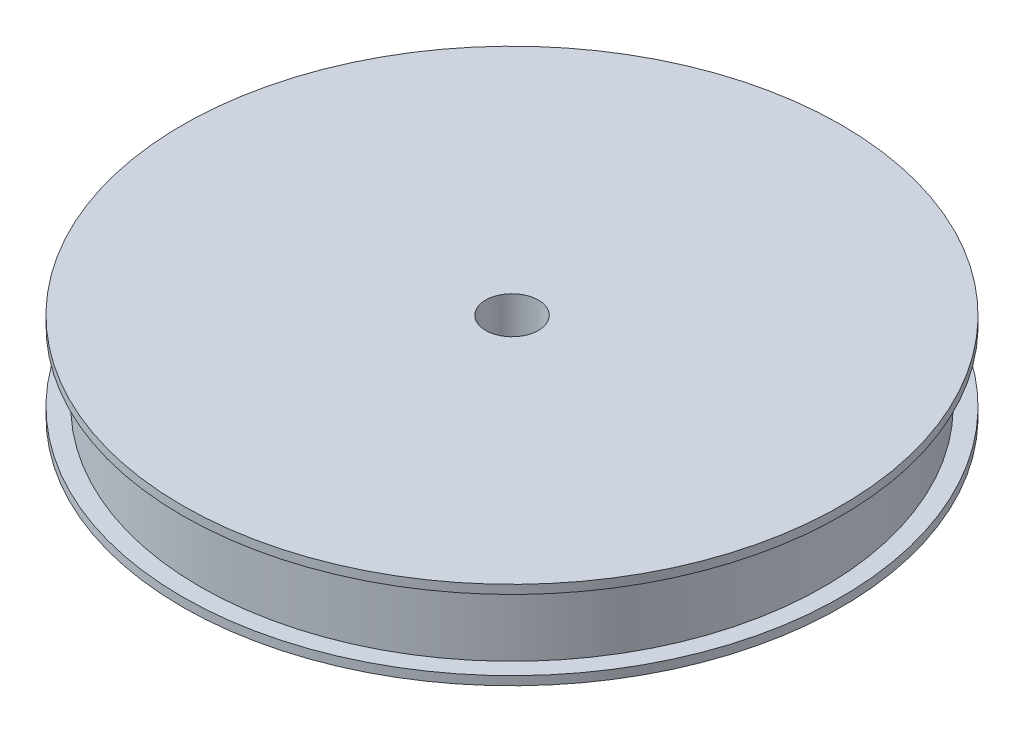
ISO-10303-21;
HEADER;
FILE_DESCRIPTION(('STEP AP214'),'2;1');
FILE_NAME('part.step','',(''),(''),'','','');
FILE_SCHEMA(('AUTOMOTIVE_DESIGN { 1 0 10303 214 1 1 1 1 }'));
ENDSEC;
DATA;
#1=APPLICATION_CONTEXT('core data for automotive mechanical design processes');
#2=APPLICATION_PROTOCOL_DEFINITION('international standard','automotive_design',2000,#1);
#3=PRODUCT_CONTEXT('',#1,'mechanical');
#4=PRODUCT('Part','Part','',(#3));
#5=PRODUCT_RELATED_PRODUCT_CATEGORY('part','',(#4));
#6=PRODUCT_DEFINITION_FORMATION('','',#4);
#7=PRODUCT_DEFINITION_CONTEXT('part definition',#1,'design');
#8=PRODUCT_DEFINITION('design','',#6,#7);
#9=PRODUCT_DEFINITION_SHAPE('','',#8);
#10=(LENGTH_UNIT() NAMED_UNIT(*) SI_UNIT(.MILLI.,.METRE.));
#11=(NAMED_UNIT(*) PLANE_ANGLE_UNIT() SI_UNIT($,.RADIAN.));
#12=(NAMED_UNIT(*) SI_UNIT($,.STERADIAN.) SOLID_ANGLE_UNIT());
#13=UNCERTAINTY_MEASURE_WITH_UNIT(LENGTH_MEASURE(1.E-05),#10,'distance_accuracy_value','');
#14=(GEOMETRIC_REPRESENTATION_CONTEXT(3) GLOBAL_UNCERTAINTY_ASSIGNED_CONTEXT((#13)) GLOBAL_UNIT_ASSIGNED_CONTEXT((#10,
#11,#12)) REPRESENTATION_CONTEXT('',''));
#15=CARTESIAN_POINT('',(0.,0.,0.));
#16=DIRECTION('',(0.,0.,1.));
#17=DIRECTION('',(1.,0.,0.));
#18=AXIS2_PLACEMENT_3D('',#15,#16,#17);
#19=CARTESIAN_POINT('',(0.,14.3943700165053,0.));
#20=DIRECTION('',(0.,1.,0.));
#21=DIRECTION('',(0.,0.,1.));
#22=AXIS2_PLACEMENT_3D('',#19,#20,#21);
#23=CYLINDRICAL_SURFACE('',#22,1.5);
#24=CARTESIAN_POINT('',(0.,2.5,0.));
#25=DIRECTION('',(0.,1.,0.));
#26=DIRECTION('',(0.,0.,1.));
#27=AXIS2_PLACEMENT_3D('',#24,#25,#26);
#28=CIRCLE('',#27,1.5);
#29=CARTESIAN_POINT('',(0.,2.5,1.5));
#30=VERTEX_POINT('',#29);
#31=EDGE_CURVE('E56',#30,#30,#28,.T.);
#32=ORIENTED_EDGE('',*,*,#31,.T.);
#33=EDGE_LOOP('',(#32));
#34=FACE_BOUND('',#33,.T.);
#35=CARTESIAN_POINT('',(0.,-2.5,0.));
#36=DIRECTION('',(0.,1.,0.));
#37=DIRECTION('',(0.,0.,1.));
#38=AXIS2_PLACEMENT_3D('',#35,#36,#37);
#39=CIRCLE('',#38,1.5);
#40=CARTESIAN_POINT('',(0.,-2.5,1.5));
#41=VERTEX_POINT('',#40);
#42=EDGE_CURVE('E74',#41,#41,#39,.T.);
#43=ORIENTED_EDGE('',*,*,#42,.F.);
#44=EDGE_LOOP('',(#43));
#45=FACE_BOUND('',#44,.T.);
#46=ADVANCED_FACE('F39',(#34,#45),#23,.F.);
#47=CARTESIAN_POINT('',(0.,14.3943700165053,0.));
#48=DIRECTION('',(0.,1.,0.));
#49=DIRECTION('',(0.,0.,1.));
#50=AXIS2_PLACEMENT_3D('',#47,#48,#49);
#51=CYLINDRICAL_SURFACE('',#50,17.75);
#52=CARTESIAN_POINT('',(0.,1.99999999999999,0.));
#53=DIRECTION('',(0.,1.,0.));
#54=DIRECTION('',(0.,0.,1.));
#55=AXIS2_PLACEMENT_3D('',#52,#53,#54);
#56=CIRCLE('',#55,17.75);
#57=CARTESIAN_POINT('',(0.,1.99999999999999,17.75));
#58=VERTEX_POINT('',#57);
#59=EDGE_CURVE('E10',#58,#58,#56,.T.);
#60=ORIENTED_EDGE('',*,*,#59,.F.);
#61=EDGE_LOOP('',(#60));
#62=FACE_BOUND('',#61,.T.);
#63=CARTESIAN_POINT('',(0.,-1.99999999999999,0.));
#64=DIRECTION('',(0.,1.,0.));
#65=DIRECTION('',(0.,0.,1.));
#66=AXIS2_PLACEMENT_3D('',#63,#64,#65);
#67=CIRCLE('',#66,17.75);
#68=CARTESIAN_POINT('',(0.,-1.99999999999999,17.75));
#69=VERTEX_POINT('',#68);
#70=EDGE_CURVE('E62',#69,#69,#67,.T.);
#71=ORIENTED_EDGE('',*,*,#70,.T.);
#72=EDGE_LOOP('',(#71));
#73=FACE_BOUND('',#72,.T.);
#74=ADVANCED_FACE('F82',(#62,#73),#51,.T.);
#75=CARTESIAN_POINT('',(-18.75,2.,0.));
#76=DIRECTION('',(0.,-1.,0.));
#77=DIRECTION('',(0.,0.,-1.));
#78=AXIS2_PLACEMENT_3D('',#75,#76,#77);
#79=PLANE('',#78);
#80=ORIENTED_EDGE('',*,*,#59,.T.);
#81=EDGE_LOOP('',(#80));
#82=FACE_BOUND('',#81,.T.);
#83=CARTESIAN_POINT('',(0.,1.99999999999999,0.));
#84=DIRECTION('',(0.,1.,0.));
#85=DIRECTION('',(0.,0.,1.));
#86=AXIS2_PLACEMENT_3D('',#83,#84,#85);
#87=CIRCLE('',#86,18.75);
#88=CARTESIAN_POINT('',(0.,1.99999999999999,18.75));
#89=VERTEX_POINT('',#88);
#90=EDGE_CURVE('E46',#89,#89,#87,.T.);
#91=ORIENTED_EDGE('',*,*,#90,.F.);
#92=EDGE_LOOP('',(#91));
#93=FACE_BOUND('',#92,.T.);
#94=ADVANCED_FACE('F87',(#82,#93),#79,.T.);
#95=CARTESIAN_POINT('',(0.,14.3943700165053,0.));
#96=DIRECTION('',(0.,1.,0.));
#97=DIRECTION('',(0.,0.,1.));
#98=AXIS2_PLACEMENT_3D('',#95,#96,#97);
#99=CYLINDRICAL_SURFACE('',#98,18.75);
#100=ORIENTED_EDGE('',*,*,#90,.T.);
#101=EDGE_LOOP('',(#100));
#102=FACE_BOUND('',#101,.T.);
#103=CARTESIAN_POINT('',(0.,2.5,0.));
#104=DIRECTION('',(0.,1.,0.));
#105=DIRECTION('',(0.,0.,1.));
#106=AXIS2_PLACEMENT_3D('',#103,#104,#105);
#107=CIRCLE('',#106,18.75);
#108=CARTESIAN_POINT('',(0.,2.5,18.75));
#109=VERTEX_POINT('',#108);
#110=EDGE_CURVE('E51',#109,#109,#107,.T.);
#111=ORIENTED_EDGE('',*,*,#110,.F.);
#112=EDGE_LOOP('',(#111));
#113=FACE_BOUND('',#112,.T.);
#114=ADVANCED_FACE('F94',(#102,#113),#99,.T.);
#115=CARTESIAN_POINT('',(-13.1465406437666,2.5,0.));
#116=DIRECTION('',(0.,-1.,0.));
#117=DIRECTION('',(0.,0.,-1.));
#118=AXIS2_PLACEMENT_3D('',#115,#116,#117);
#119=PLANE('',#118);
#120=ORIENTED_EDGE('',*,*,#110,.T.);
#121=EDGE_LOOP('',(#120));
#122=FACE_BOUND('',#121,.T.);
#123=ORIENTED_EDGE('',*,*,#31,.F.);
#124=EDGE_LOOP('',(#123));
#125=FACE_BOUND('',#124,.T.);
#126=ADVANCED_FACE('F91',(#122,#125),#119,.F.);
#127=CARTESIAN_POINT('',(-18.75,-2.,0.));
#128=DIRECTION('',(0.,1.,0.));
#129=DIRECTION('',(0.,0.,-1.));
#130=AXIS2_PLACEMENT_3D('',#127,#128,#129);
#131=PLANE('',#130);
#132=ORIENTED_EDGE('',*,*,#70,.F.);
#133=EDGE_LOOP('',(#132));
#134=FACE_BOUND('',#133,.T.);
#135=CARTESIAN_POINT('',(0.,-1.99999999999999,0.));
#136=DIRECTION('',(0.,1.,0.));
#137=DIRECTION('',(0.,0.,1.));
#138=AXIS2_PLACEMENT_3D('',#135,#136,#137);
#139=CIRCLE('',#138,18.75);
#140=CARTESIAN_POINT('',(0.,-1.99999999999999,18.75));
#141=VERTEX_POINT('',#140);
#142=EDGE_CURVE('E66',#141,#141,#139,.T.);
#143=ORIENTED_EDGE('',*,*,#142,.T.);
#144=EDGE_LOOP('',(#143));
#145=FACE_BOUND('',#144,.T.);
#146=ADVANCED_FACE('F93',(#134,#145),#131,.T.);
#147=CARTESIAN_POINT('',(0.,-14.3943700165053,0.));
#148=DIRECTION('',(0.,-1.,0.));
#149=DIRECTION('',(0.,0.,1.));
#150=AXIS2_PLACEMENT_3D('',#147,#148,#149);
#151=CYLINDRICAL_SURFACE('',#150,18.75);
#152=ORIENTED_EDGE('',*,*,#142,.F.);
#153=EDGE_LOOP('',(#152));
#154=FACE_BOUND('',#153,.T.);
#155=CARTESIAN_POINT('',(0.,-2.5,0.));
#156=DIRECTION('',(0.,1.,0.));
#157=DIRECTION('',(0.,0.,1.));
#158=AXIS2_PLACEMENT_3D('',#155,#156,#157);
#159=CIRCLE('',#158,18.75);
#160=CARTESIAN_POINT('',(0.,-2.5,18.75));
#161=VERTEX_POINT('',#160);
#162=EDGE_CURVE('E70',#161,#161,#159,.T.);
#163=ORIENTED_EDGE('',*,*,#162,.T.);
#164=EDGE_LOOP('',(#163));
#165=FACE_BOUND('',#164,.T.);
#166=ADVANCED_FACE('F101',(#154,#165),#151,.T.);
#167=CARTESIAN_POINT('',(-13.1465406437666,-2.5,0.));
#168=DIRECTION('',(0.,1.,0.));
#169=DIRECTION('',(0.,0.,-1.));
#170=AXIS2_PLACEMENT_3D('',#167,#168,#169);
#171=PLANE('',#170);
#172=ORIENTED_EDGE('',*,*,#162,.F.);
#173=EDGE_LOOP('',(#172));
#174=FACE_BOUND('',#173,.T.);
#175=ORIENTED_EDGE('',*,*,#42,.T.);
#176=EDGE_LOOP('',(#175));
#177=FACE_BOUND('',#176,.T.);
#178=ADVANCED_FACE('F79',(#174,#177),#171,.F.);
#179=CLOSED_SHELL('',(#46,#74,#94,#114,#126,#146,#166,#178));
#180=MANIFOLD_SOLID_BREP('B2',#179);
#181=ADVANCED_BREP_SHAPE_REPRESENTATION('',(#18,#180),#14);
#182=SHAPE_DEFINITION_REPRESENTATION(#9,#181);
ENDSEC;
END-ISO-10303-21;
